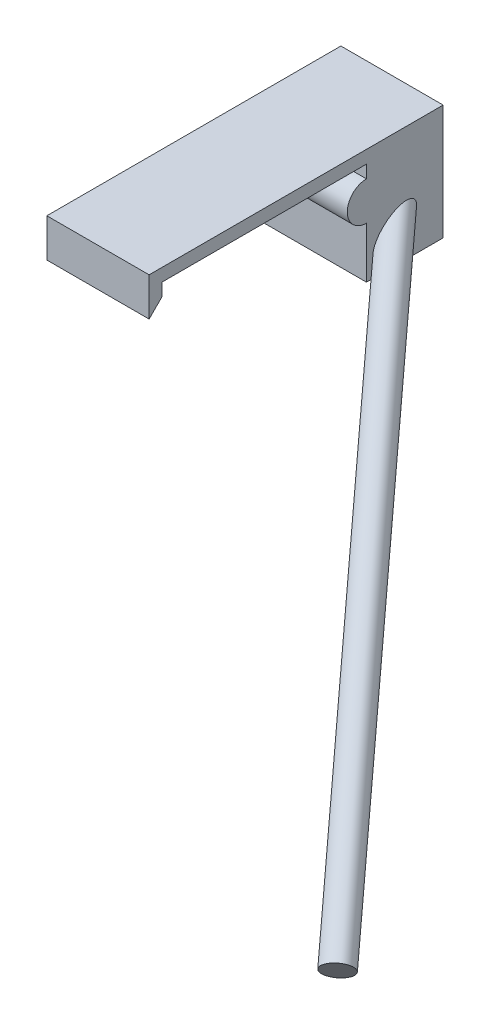
ISO-10303-21;
HEADER;
FILE_DESCRIPTION(('STEP AP214'),'2;1');
FILE_NAME('part.step','',(''),(''),'','','');
FILE_SCHEMA(('AUTOMOTIVE_DESIGN { 1 0 10303 214 1 1 1 1 }'));
ENDSEC;
DATA;
#1=APPLICATION_CONTEXT('core data for automotive mechanical design processes');
#2=APPLICATION_PROTOCOL_DEFINITION('international standard','automotive_design',2000,#1);
#3=PRODUCT_CONTEXT('',#1,'mechanical');
#4=PRODUCT('Part','Part','',(#3));
#5=PRODUCT_RELATED_PRODUCT_CATEGORY('part','',(#4));
#6=PRODUCT_DEFINITION_FORMATION('','',#4);
#7=PRODUCT_DEFINITION_CONTEXT('part definition',#1,'design');
#8=PRODUCT_DEFINITION('design','',#6,#7);
#9=PRODUCT_DEFINITION_SHAPE('','',#8);
#10=(LENGTH_UNIT() NAMED_UNIT(*) SI_UNIT(.MILLI.,.METRE.));
#11=(NAMED_UNIT(*) PLANE_ANGLE_UNIT() SI_UNIT($,.RADIAN.));
#12=(NAMED_UNIT(*) SI_UNIT($,.STERADIAN.) SOLID_ANGLE_UNIT());
#13=UNCERTAINTY_MEASURE_WITH_UNIT(LENGTH_MEASURE(1.E-05),#10,'distance_accuracy_value','');
#14=(GEOMETRIC_REPRESENTATION_CONTEXT(3) GLOBAL_UNCERTAINTY_ASSIGNED_CONTEXT((#13)) GLOBAL_UNIT_ASSIGNED_CONTEXT((#10,
#11,#12)) REPRESENTATION_CONTEXT('',''));
#15=CARTESIAN_POINT('',(0.,0.,0.));
#16=DIRECTION('',(0.,0.,1.));
#17=DIRECTION('',(1.,0.,0.));
#18=AXIS2_PLACEMENT_3D('',#15,#16,#17);
#19=CARTESIAN_POINT('',(-19.05,-25.4,-25.4));
#20=DIRECTION('',(0.,0.,1.));
#21=DIRECTION('',(1.,0.,0.));
#22=AXIS2_PLACEMENT_3D('',#19,#20,#21);
#23=PLANE('',#22);
#24=DIRECTION('',(1.,0.,0.));
#25=VECTOR('',#24,1.);
#26=CARTESIAN_POINT('',(-16.9992737428428,-12.7,-25.4));
#27=LINE('',#26,#25);
#28=CARTESIAN_POINT('',(-6.35,-12.7,-25.4));
#29=VERTEX_POINT('',#28);
#30=CARTESIAN_POINT('',(19.05,-12.7,-25.4));
#31=VERTEX_POINT('',#30);
#32=EDGE_CURVE('E197',#29,#31,#27,.T.);
#33=ORIENTED_EDGE('',*,*,#32,.F.);
#34=DIRECTION('',(0.,1.,0.));
#35=VECTOR('',#34,1.);
#36=CARTESIAN_POINT('',(-6.35,-25.4,-25.4));
#37=LINE('',#36,#35);
#38=CARTESIAN_POINT('',(-6.35,-25.4,-25.4));
#39=VERTEX_POINT('',#38);
#40=EDGE_CURVE('E144',#39,#29,#37,.T.);
#41=ORIENTED_EDGE('',*,*,#40,.F.);
#42=DIRECTION('',(1.,0.,0.));
#43=VECTOR('',#42,1.);
#44=CARTESIAN_POINT('',(-19.05,-25.4,-25.4));
#45=LINE('',#44,#43);
#46=CARTESIAN_POINT('',(19.05,-25.4,-25.4));
#47=VERTEX_POINT('',#46);
#48=EDGE_CURVE('E162',#39,#47,#45,.T.);
#49=ORIENTED_EDGE('',*,*,#48,.T.);
#50=DIRECTION('',(0.,1.,0.));
#51=VECTOR('',#50,1.);
#52=CARTESIAN_POINT('',(19.05,-25.4,-25.4));
#53=LINE('',#52,#51);
#54=EDGE_CURVE('E178',#47,#31,#53,.T.);
#55=ORIENTED_EDGE('',*,*,#54,.T.);
#56=EDGE_LOOP('',(#33,#41,#49,#55));
#57=FACE_BOUND('',#56,.T.);
#58=ADVANCED_FACE('F37',(#57),#23,.T.);
#59=CARTESIAN_POINT('',(19.05,3.175,25.4));
#60=DIRECTION('',(-1.,0.,0.));
#61=DIRECTION('',(0.,0.,1.));
#62=AXIS2_PLACEMENT_3D('',#59,#60,#61);
#63=PLANE('',#62);
#64=CARTESIAN_POINT('',(19.05,-17.6816622483046,-32.4344590383189));
#65=DIRECTION('',(-1.,0.,0.));
#66=DIRECTION('',(0.,-0.644400477571771,0.764688187763662));
#67=AXIS2_PLACEMENT_3D('',#64,#65,#66);
#68=ELLIPSE('',#67,6.44759049028298,3.4925);
#69=CARTESIAN_POINT('',(19.05,-21.8364926394302,-27.5040627508622));
#70=VERTEX_POINT('',#69);
#71=EDGE_CURVE('E11',#70,#70,#68,.F.);
#72=ORIENTED_EDGE('',*,*,#71,.F.);
#73=EDGE_LOOP('',(#72));
#74=FACE_BOUND('',#73,.T.);
#75=DIRECTION('',(0.,1.,0.));
#76=VECTOR('',#75,1.);
#77=CARTESIAN_POINT('',(19.05,3.175,28.575));
#78=LINE('',#77,#76);
#79=CARTESIAN_POINT('',(19.05,-6.35,28.575));
#80=VERTEX_POINT('',#79);
#81=CARTESIAN_POINT('',(19.05,3.175,28.575));
#82=VERTEX_POINT('',#81);
#83=EDGE_CURVE('E129',#80,#82,#78,.T.);
#84=ORIENTED_EDGE('',*,*,#83,.F.);
#85=DIRECTION('',(0.,-0.707106781186547,0.707106781186547));
#86=VECTOR('',#85,1.);
#87=CARTESIAN_POINT('',(19.05,-3.175,25.4));
#88=LINE('',#87,#86);
#89=CARTESIAN_POINT('',(19.05,-3.175,25.4));
#90=VERTEX_POINT('',#89);
#91=EDGE_CURVE('E116',#90,#80,#88,.T.);
#92=ORIENTED_EDGE('',*,*,#91,.F.);
#93=DIRECTION('',(0.,1.,0.));
#94=VECTOR('',#93,1.);
#95=CARTESIAN_POINT('',(19.05,3.175,25.4));
#96=LINE('',#95,#94);
#97=CARTESIAN_POINT('',(19.05,0.,25.4));
#98=VERTEX_POINT('',#97);
#99=EDGE_CURVE('E126',#90,#98,#96,.T.);
#100=ORIENTED_EDGE('',*,*,#99,.T.);
#101=DIRECTION('',(0.,0.,-1.));
#102=VECTOR('',#101,1.);
#103=CARTESIAN_POINT('',(19.05,0.,25.4));
#104=LINE('',#103,#102);
#105=CARTESIAN_POINT('',(19.05,0.,-25.4));
#106=VERTEX_POINT('',#105);
#107=EDGE_CURVE('E177',#98,#106,#104,.T.);
#108=ORIENTED_EDGE('',*,*,#107,.T.);
#109=CARTESIAN_POINT('',(19.05,-3.175,-25.4));
#110=VERTEX_POINT('',#109);
#111=EDGE_CURVE('E171',#110,#106,#53,.T.);
#112=ORIENTED_EDGE('',*,*,#111,.F.);
#113=CARTESIAN_POINT('',(19.05,-7.9375,-25.4));
#114=DIRECTION('',(1.,0.,0.));
#115=DIRECTION('',(0.,0.,-1.));
#116=AXIS2_PLACEMENT_3D('',#113,#114,#115);
#117=CIRCLE('',#116,4.7625);
#118=EDGE_CURVE('E195',#110,#31,#117,.T.);
#119=ORIENTED_EDGE('',*,*,#118,.T.);
#120=ORIENTED_EDGE('',*,*,#54,.F.);
#121=DIRECTION('',(0.,0.,-1.));
#122=VECTOR('',#121,1.);
#123=CARTESIAN_POINT('',(19.05,-25.4,-44.45));
#124=LINE('',#123,#122);
#125=CARTESIAN_POINT('',(19.05,-25.4,-44.45));
#126=VERTEX_POINT('',#125);
#127=EDGE_CURVE('E164',#47,#126,#124,.T.);
#128=ORIENTED_EDGE('',*,*,#127,.T.);
#129=DIRECTION('',(0.,1.,0.));
#130=VECTOR('',#129,1.);
#131=CARTESIAN_POINT('',(19.05,-25.4,-44.45));
#132=LINE('',#131,#130);
#133=CARTESIAN_POINT('',(19.05,3.175,-44.45));
#134=VERTEX_POINT('',#133);
#135=EDGE_CURVE('E174',#126,#134,#132,.T.);
#136=ORIENTED_EDGE('',*,*,#135,.T.);
#137=DIRECTION('',(0.,0.,-1.));
#138=VECTOR('',#137,1.);
#139=CARTESIAN_POINT('',(19.05,3.175,25.4));
#140=LINE('',#139,#138);
#141=EDGE_CURVE('E46',#82,#134,#140,.T.);
#142=ORIENTED_EDGE('',*,*,#141,.F.);
#143=EDGE_LOOP('',(#84,#92,#100,#108,#112,#119,#120,#128,#136,#142));
#144=FACE_BOUND('',#143,.T.);
#145=ADVANCED_FACE('F39',(#74,#144),#63,.F.);
#146=CARTESIAN_POINT('',(0.,3.175,0.));
#147=DIRECTION('',(0.,-1.,0.));
#148=DIRECTION('',(0.,0.,-1.));
#149=AXIS2_PLACEMENT_3D('',#146,#147,#148);
#150=PLANE('',#149);
#151=DIRECTION('',(-1.,0.,0.));
#152=VECTOR('',#151,1.);
#153=CARTESIAN_POINT('',(-19.05,3.175,-44.45));
#154=LINE('',#153,#152);
#155=CARTESIAN_POINT('',(-6.35,3.175,-44.45));
#156=VERTEX_POINT('',#155);
#157=EDGE_CURVE('E165',#134,#156,#154,.T.);
#158=ORIENTED_EDGE('',*,*,#157,.T.);
#159=DIRECTION('',(0.,0.,-1.));
#160=VECTOR('',#159,1.);
#161=CARTESIAN_POINT('',(-6.35,3.175,25.4));
#162=LINE('',#161,#160);
#163=CARTESIAN_POINT('',(-6.35,3.175,28.575));
#164=VERTEX_POINT('',#163);
#165=EDGE_CURVE('E150',#164,#156,#162,.T.);
#166=ORIENTED_EDGE('',*,*,#165,.F.);
#167=DIRECTION('',(-1.,0.,0.));
#168=VECTOR('',#167,1.);
#169=CARTESIAN_POINT('',(19.05,3.175,28.575));
#170=LINE('',#169,#168);
#171=EDGE_CURVE('E216',#82,#164,#170,.T.);
#172=ORIENTED_EDGE('',*,*,#171,.F.);
#173=ORIENTED_EDGE('',*,*,#141,.T.);
#174=EDGE_LOOP('',(#158,#166,#172,#173));
#175=FACE_BOUND('',#174,.T.);
#176=ADVANCED_FACE('F214',(#175),#150,.F.);
#177=CARTESIAN_POINT('',(0.,0.,0.));
#178=DIRECTION('',(0.,-1.,0.));
#179=DIRECTION('',(0.,0.,-1.));
#180=AXIS2_PLACEMENT_3D('',#177,#178,#179);
#181=PLANE('',#180);
#182=DIRECTION('',(0.,0.,1.));
#183=VECTOR('',#182,1.);
#184=CARTESIAN_POINT('',(-6.35,0.,-25.4));
#185=LINE('',#184,#183);
#186=CARTESIAN_POINT('',(-6.35,0.,-25.4));
#187=VERTEX_POINT('',#186);
#188=CARTESIAN_POINT('',(-6.35,0.,25.4));
#189=VERTEX_POINT('',#188);
#190=EDGE_CURVE('E147',#187,#189,#185,.T.);
#191=ORIENTED_EDGE('',*,*,#190,.F.);
#192=DIRECTION('',(-1.,0.,0.));
#193=VECTOR('',#192,1.);
#194=CARTESIAN_POINT('',(-19.05,0.,-25.4));
#195=LINE('',#194,#193);
#196=EDGE_CURVE('E183',#106,#187,#195,.T.);
#197=ORIENTED_EDGE('',*,*,#196,.F.);
#198=ORIENTED_EDGE('',*,*,#107,.F.);
#199=DIRECTION('',(1.,0.,0.));
#200=VECTOR('',#199,1.);
#201=CARTESIAN_POINT('',(-19.05,0.,25.4));
#202=LINE('',#201,#200);
#203=EDGE_CURVE('E134',#189,#98,#202,.T.);
#204=ORIENTED_EDGE('',*,*,#203,.F.);
#205=EDGE_LOOP('',(#191,#197,#198,#204));
#206=FACE_BOUND('',#205,.T.);
#207=ADVANCED_FACE('F192',(#206),#181,.T.);
#208=CARTESIAN_POINT('',(-19.05,-25.4,-44.45));
#209=DIRECTION('',(0.,0.,-1.));
#210=DIRECTION('',(-1.,0.,0.));
#211=AXIS2_PLACEMENT_3D('',#208,#209,#210);
#212=PLANE('',#211);
#213=DIRECTION('',(0.,-1.,0.));
#214=VECTOR('',#213,1.);
#215=CARTESIAN_POINT('',(-6.35,3.175,-44.45));
#216=LINE('',#215,#214);
#217=CARTESIAN_POINT('',(-6.35000000000001,-25.4,-44.45));
#218=VERTEX_POINT('',#217);
#219=EDGE_CURVE('E152',#156,#218,#216,.T.);
#220=ORIENTED_EDGE('',*,*,#219,.F.);
#221=ORIENTED_EDGE('',*,*,#157,.F.);
#222=ORIENTED_EDGE('',*,*,#135,.F.);
#223=DIRECTION('',(-1.,0.,0.));
#224=VECTOR('',#223,1.);
#225=CARTESIAN_POINT('',(-19.05,-25.4,-44.45));
#226=LINE('',#225,#224);
#227=EDGE_CURVE('E168',#126,#218,#226,.T.);
#228=ORIENTED_EDGE('',*,*,#227,.T.);
#229=EDGE_LOOP('',(#220,#221,#222,#228));
#230=FACE_BOUND('',#229,.T.);
#231=CARTESIAN_POINT('',(8.92453911556498,-7.55620136386956,-44.45));
#232=DIRECTION('',(0.,0.,-1.));
#233=DIRECTION('',(0.707106781186546,-0.707106781186549,0.));
#234=AXIS2_PLACEMENT_3D('',#231,#232,#233);
#235=ELLIPSE('',#234,5.43336546530997,3.4925);
#236=CARTESIAN_POINT('',(12.7665086807505,-11.3981709290551,-44.45));
#237=VERTEX_POINT('',#236);
#238=EDGE_CURVE('E41',#237,#237,#235,.F.);
#239=ORIENTED_EDGE('',*,*,#238,.T.);
#240=EDGE_LOOP('',(#239));
#241=FACE_BOUND('',#240,.T.);
#242=ADVANCED_FACE('F211',(#230,#241),#212,.T.);
#243=DIRECTION('',(1.,0.,0.));
#244=VECTOR('',#243,1.);
#245=CARTESIAN_POINT('',(-16.9992737428428,-3.175,-25.4));
#246=LINE('',#245,#244);
#247=CARTESIAN_POINT('',(-6.35,-3.175,-25.4));
#248=VERTEX_POINT('',#247);
#249=EDGE_CURVE('E62',#248,#110,#246,.T.);
#250=ORIENTED_EDGE('',*,*,#249,.T.);
#251=ORIENTED_EDGE('',*,*,#111,.T.);
#252=ORIENTED_EDGE('',*,*,#196,.T.);
#253=EDGE_CURVE('E148',#248,#187,#37,.T.);
#254=ORIENTED_EDGE('',*,*,#253,.F.);
#255=EDGE_LOOP('',(#250,#251,#252,#254));
#256=FACE_BOUND('',#255,.T.);
#257=ADVANCED_FACE('F188',(#256),#23,.T.);
#258=CARTESIAN_POINT('',(0.,-25.4,0.));
#259=DIRECTION('',(0.,-1.,0.));
#260=DIRECTION('',(0.,0.,-1.));
#261=AXIS2_PLACEMENT_3D('',#258,#259,#260);
#262=PLANE('',#261);
#263=DIRECTION('',(0.,0.,1.));
#264=VECTOR('',#263,1.);
#265=CARTESIAN_POINT('',(-6.35,-25.4,-44.45));
#266=LINE('',#265,#264);
#267=EDGE_CURVE('E154',#218,#39,#266,.T.);
#268=ORIENTED_EDGE('',*,*,#267,.F.);
#269=ORIENTED_EDGE('',*,*,#227,.F.);
#270=ORIENTED_EDGE('',*,*,#127,.F.);
#271=ORIENTED_EDGE('',*,*,#48,.F.);
#272=EDGE_LOOP('',(#268,#269,#270,#271));
#273=FACE_BOUND('',#272,.T.);
#274=ADVANCED_FACE('F205',(#273),#262,.T.);
#275=CARTESIAN_POINT('',(5.70565192975676,-4.33731417806133,-48.2697442342169));
#276=DIRECTION('',(-0.5416752204197,0.541675220419702,-0.642787609686541));
#277=DIRECTION('',(0.,0.764688187763662,0.644400477571771));
#278=AXIS2_PLACEMENT_3D('',#275,#276,#277);
#279=PLANE('',#278);
#280=CARTESIAN_POINT('',(5.70565192975676,-4.33731417806133,-48.2697442342169));
#281=DIRECTION('',(-0.5416752204197,0.541675220419702,-0.642787609686541));
#282=DIRECTION('',(0.,0.764688187763662,0.644400477571771));
#283=AXIS2_PLACEMENT_3D('',#280,#281,#282);
#284=CIRCLE('',#283,3.4925);
#285=CARTESIAN_POINT('',(5.70565192975676,-1.66664068229675,-46.0191755662975));
#286=VERTEX_POINT('',#285);
#287=EDGE_CURVE('E159',#286,#286,#284,.T.);
#288=ORIENTED_EDGE('',*,*,#287,.T.);
#289=EDGE_LOOP('',(#288));
#290=FACE_BOUND('',#289,.T.);
#291=ADVANCED_FACE('F252',(#290),#279,.T.);
#292=CARTESIAN_POINT('',(5.70565192975676,-4.33731417806133,-48.2697442342169));
#293=DIRECTION('',(0.5416752204197,-0.541675220419702,0.642787609686541));
#294=DIRECTION('',(0.,-0.764688187763662,-0.644400477571771));
#295=AXIS2_PLACEMENT_3D('',#292,#293,#294);
#296=CYLINDRICAL_SURFACE('',#295,3.4925);
#297=ORIENTED_EDGE('',*,*,#238,.F.);
#298=EDGE_LOOP('',(#297));
#299=FACE_BOUND('',#298,.T.);
#300=ORIENTED_EDGE('',*,*,#287,.F.);
#301=EDGE_LOOP('',(#300));
#302=FACE_BOUND('',#301,.T.);
#303=ADVANCED_FACE('F258',(#299,#302),#296,.T.);
#304=CARTESIAN_POINT('',(95.1362308210493,-93.7678930693542,57.854490125031));
#305=DIRECTION('',(-0.5416752204197,0.541675220419702,-0.642787609686541));
#306=DIRECTION('',(0.,0.764688187763662,0.644400477571771));
#307=AXIS2_PLACEMENT_3D('',#304,#305,#306);
#308=CIRCLE('',#307,3.4925);
#309=CARTESIAN_POINT('',(95.1362308210493,-91.0972195735896,60.1050587929504));
#310=VERTEX_POINT('',#309);
#311=EDGE_CURVE('E156',#310,#310,#308,.T.);
#312=ORIENTED_EDGE('',*,*,#311,.T.);
#313=EDGE_LOOP('',(#312));
#314=FACE_BOUND('',#313,.T.);
#315=ORIENTED_EDGE('',*,*,#71,.T.);
#316=EDGE_LOOP('',(#315));
#317=FACE_BOUND('',#316,.T.);
#318=ADVANCED_FACE('F261',(#314,#317),#296,.T.);
#319=CARTESIAN_POINT('',(95.1362308210493,-93.7678930693542,57.854490125031));
#320=DIRECTION('',(-0.5416752204197,0.541675220419702,-0.642787609686541));
#321=DIRECTION('',(0.,0.764688187763662,0.644400477571771));
#322=AXIS2_PLACEMENT_3D('',#319,#320,#321);
#323=PLANE('',#322);
#324=ORIENTED_EDGE('',*,*,#311,.F.);
#325=EDGE_LOOP('',(#324));
#326=FACE_BOUND('',#325,.T.);
#327=ADVANCED_FACE('F266',(#326),#323,.F.);
#328=CARTESIAN_POINT('',(-6.35,0.,0.));
#329=DIRECTION('',(1.,0.,0.));
#330=DIRECTION('',(0.,0.,-1.));
#331=AXIS2_PLACEMENT_3D('',#328,#329,#330);
#332=PLANE('',#331);
#333=DIRECTION('',(0.,-1.,0.));
#334=VECTOR('',#333,1.);
#335=CARTESIAN_POINT('',(-6.35,3.175,25.4));
#336=LINE('',#335,#334);
#337=CARTESIAN_POINT('',(-6.35,-3.175,25.4));
#338=VERTEX_POINT('',#337);
#339=EDGE_CURVE('E135',#189,#338,#336,.T.);
#340=ORIENTED_EDGE('',*,*,#339,.T.);
#341=DIRECTION('',(0.,0.707106781186548,-0.707106781186548));
#342=VECTOR('',#341,1.);
#343=CARTESIAN_POINT('',(-6.35,-3.175,25.4));
#344=LINE('',#343,#342);
#345=CARTESIAN_POINT('',(-6.35,-6.35,28.575));
#346=VERTEX_POINT('',#345);
#347=EDGE_CURVE('E54',#346,#338,#344,.T.);
#348=ORIENTED_EDGE('',*,*,#347,.F.);
#349=DIRECTION('',(0.,-1.,0.));
#350=VECTOR('',#349,1.);
#351=CARTESIAN_POINT('',(-6.35,3.175,28.575));
#352=LINE('',#351,#350);
#353=EDGE_CURVE('E220',#164,#346,#352,.T.);
#354=ORIENTED_EDGE('',*,*,#353,.F.);
#355=ORIENTED_EDGE('',*,*,#165,.T.);
#356=ORIENTED_EDGE('',*,*,#219,.T.);
#357=ORIENTED_EDGE('',*,*,#267,.T.);
#358=ORIENTED_EDGE('',*,*,#40,.T.);
#359=CARTESIAN_POINT('',(-6.35,-7.9375,-25.4));
#360=DIRECTION('',(1.,0.,0.));
#361=DIRECTION('',(0.,0.,-1.));
#362=AXIS2_PLACEMENT_3D('',#359,#360,#361);
#363=CIRCLE('',#362,4.7625);
#364=EDGE_CURVE('E136',#29,#248,#363,.F.);
#365=ORIENTED_EDGE('',*,*,#364,.T.);
#366=ORIENTED_EDGE('',*,*,#253,.T.);
#367=ORIENTED_EDGE('',*,*,#190,.T.);
#368=EDGE_LOOP('',(#340,#348,#354,#355,#356,#357,#358,#365,#366,#367));
#369=FACE_BOUND('',#368,.T.);
#370=ADVANCED_FACE('F227',(#369),#332,.F.);
#371=CARTESIAN_POINT('',(0.,0.,28.575));
#372=DIRECTION('',(0.,0.,-1.));
#373=DIRECTION('',(-1.,0.,0.));
#374=AXIS2_PLACEMENT_3D('',#371,#372,#373);
#375=PLANE('',#374);
#376=ORIENTED_EDGE('',*,*,#83,.T.);
#377=ORIENTED_EDGE('',*,*,#171,.T.);
#378=ORIENTED_EDGE('',*,*,#353,.T.);
#379=DIRECTION('',(1.,0.,0.));
#380=VECTOR('',#379,1.);
#381=CARTESIAN_POINT('',(19.05,-6.35,28.575));
#382=LINE('',#381,#380);
#383=EDGE_CURVE('E141',#346,#80,#382,.T.);
#384=ORIENTED_EDGE('',*,*,#383,.T.);
#385=EDGE_LOOP('',(#376,#377,#378,#384));
#386=FACE_BOUND('',#385,.T.);
#387=ADVANCED_FACE('F222',(#386),#375,.F.);
#388=CARTESIAN_POINT('',(0.,0.,25.4));
#389=DIRECTION('',(0.,0.,-1.));
#390=DIRECTION('',(-1.,0.,0.));
#391=AXIS2_PLACEMENT_3D('',#388,#389,#390);
#392=PLANE('',#391);
#393=DIRECTION('',(1.,0.,0.));
#394=VECTOR('',#393,1.);
#395=CARTESIAN_POINT('',(-10.8401280605346,-3.175,25.4));
#396=LINE('',#395,#394);
#397=EDGE_CURVE('E113',#338,#90,#396,.T.);
#398=ORIENTED_EDGE('',*,*,#397,.F.);
#399=ORIENTED_EDGE('',*,*,#339,.F.);
#400=ORIENTED_EDGE('',*,*,#203,.T.);
#401=ORIENTED_EDGE('',*,*,#99,.F.);
#402=EDGE_LOOP('',(#398,#399,#400,#401));
#403=FACE_BOUND('',#402,.T.);
#404=ADVANCED_FACE('F132',(#403),#392,.T.);
#405=CARTESIAN_POINT('',(-16.9992737428428,-7.9375,-25.4));
#406=DIRECTION('',(1.,0.,0.));
#407=DIRECTION('',(0.,0.,-1.));
#408=AXIS2_PLACEMENT_3D('',#405,#406,#407);
#409=CYLINDRICAL_SURFACE('',#408,4.7625);
#410=ORIENTED_EDGE('',*,*,#364,.F.);
#411=ORIENTED_EDGE('',*,*,#32,.T.);
#412=ORIENTED_EDGE('',*,*,#118,.F.);
#413=ORIENTED_EDGE('',*,*,#249,.F.);
#414=EDGE_LOOP('',(#410,#411,#412,#413));
#415=FACE_BOUND('',#414,.T.);
#416=ADVANCED_FACE('F228',(#415),#409,.T.);
#417=CARTESIAN_POINT('',(-10.8401280605346,-3.175,25.4));
#418=DIRECTION('',(0.,0.707106781186548,0.707106781186548));
#419=DIRECTION('',(0.,-0.707106781186548,0.707106781186548));
#420=AXIS2_PLACEMENT_3D('',#417,#418,#419);
#421=PLANE('',#420);
#422=ORIENTED_EDGE('',*,*,#347,.T.);
#423=ORIENTED_EDGE('',*,*,#397,.T.);
#424=ORIENTED_EDGE('',*,*,#91,.T.);
#425=ORIENTED_EDGE('',*,*,#383,.F.);
#426=EDGE_LOOP('',(#422,#423,#424,#425));
#427=FACE_BOUND('',#426,.T.);
#428=ADVANCED_FACE('F115',(#427),#421,.F.);
#429=CLOSED_SHELL('',(#58,#145,#176,#207,#242,#257,#274,#291,#303,#318,#327,#370,#387,#404,#416,#428));
#430=MANIFOLD_SOLID_BREP('B2',#429);
#431=ADVANCED_BREP_SHAPE_REPRESENTATION('',(#18,#430),#14);
#432=SHAPE_DEFINITION_REPRESENTATION(#9,#431);
ENDSEC;
END-ISO-10303-21;
